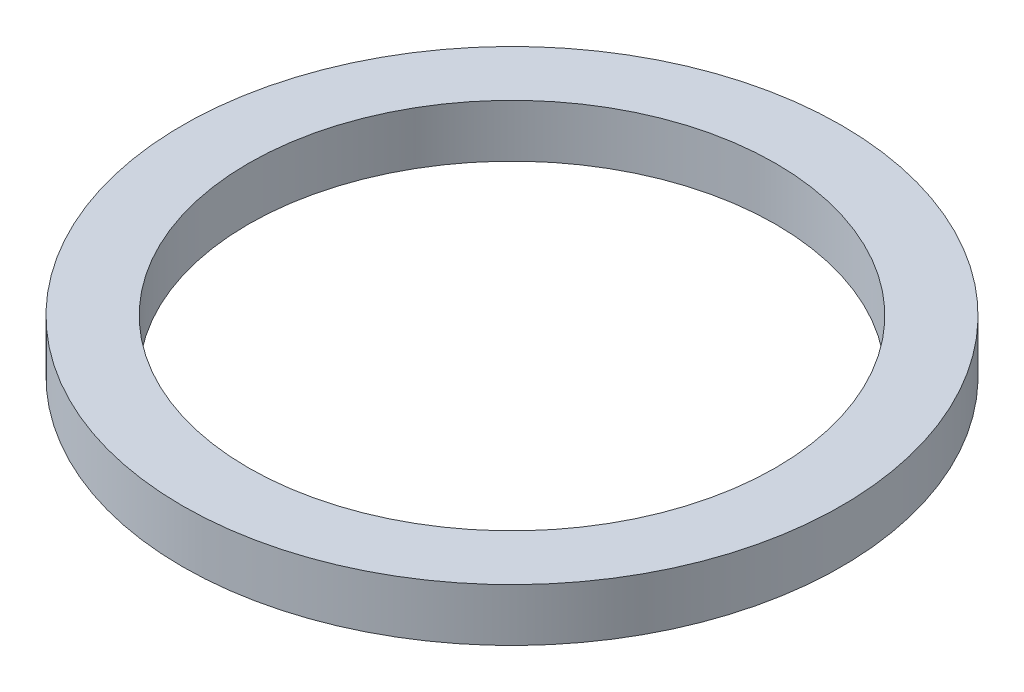
ISO-10303-21;
HEADER;
FILE_DESCRIPTION(('STEP AP214'),'2;1');
FILE_NAME('part.step','',(''),(''),'','','');
FILE_SCHEMA(('AUTOMOTIVE_DESIGN { 1 0 10303 214 1 1 1 1 }'));
ENDSEC;
DATA;
#1=APPLICATION_CONTEXT('core data for automotive mechanical design processes');
#2=APPLICATION_PROTOCOL_DEFINITION('international standard','automotive_design',2000,#1);
#3=PRODUCT_CONTEXT('',#1,'mechanical');
#4=PRODUCT('Part','Part','',(#3));
#5=PRODUCT_RELATED_PRODUCT_CATEGORY('part','',(#4));
#6=PRODUCT_DEFINITION_FORMATION('','',#4);
#7=PRODUCT_DEFINITION_CONTEXT('part definition',#1,'design');
#8=PRODUCT_DEFINITION('design','',#6,#7);
#9=PRODUCT_DEFINITION_SHAPE('','',#8);
#10=(LENGTH_UNIT() NAMED_UNIT(*) SI_UNIT(.MILLI.,.METRE.));
#11=(NAMED_UNIT(*) PLANE_ANGLE_UNIT() SI_UNIT($,.RADIAN.));
#12=(NAMED_UNIT(*) SI_UNIT($,.STERADIAN.) SOLID_ANGLE_UNIT());
#13=UNCERTAINTY_MEASURE_WITH_UNIT(LENGTH_MEASURE(1.E-05),#10,'distance_accuracy_value','');
#14=(GEOMETRIC_REPRESENTATION_CONTEXT(3) GLOBAL_UNCERTAINTY_ASSIGNED_CONTEXT((#13)) GLOBAL_UNIT_ASSIGNED_CONTEXT((#10,
#11,#12)) REPRESENTATION_CONTEXT('',''));
#15=CARTESIAN_POINT('',(0.,0.,0.));
#16=DIRECTION('',(0.,0.,1.));
#17=DIRECTION('',(1.,0.,0.));
#18=AXIS2_PLACEMENT_3D('',#15,#16,#17);
#19=CARTESIAN_POINT('',(0.,3.,0.));
#20=DIRECTION('',(0.,1.,0.));
#21=DIRECTION('',(0.,0.,1.));
#22=AXIS2_PLACEMENT_3D('',#19,#20,#21);
#23=PLANE('',#22);
#24=CARTESIAN_POINT('',(0.,3.,0.));
#25=DIRECTION('',(0.,1.,0.));
#26=DIRECTION('',(0.,0.,1.));
#27=AXIS2_PLACEMENT_3D('',#24,#25,#26);
#28=CIRCLE('',#27,18.75);
#29=CARTESIAN_POINT('',(0.,3.,18.75));
#30=VERTEX_POINT('',#29);
#31=EDGE_CURVE('E10',#30,#30,#28,.T.);
#32=ORIENTED_EDGE('',*,*,#31,.T.);
#33=EDGE_LOOP('',(#32));
#34=FACE_BOUND('',#33,.T.);
#35=CARTESIAN_POINT('',(0.,3.,0.));
#36=DIRECTION('',(0.,1.,0.));
#37=DIRECTION('',(0.,0.,1.));
#38=AXIS2_PLACEMENT_3D('',#35,#36,#37);
#39=CIRCLE('',#38,15.);
#40=CARTESIAN_POINT('',(0.,3.,15.));
#41=VERTEX_POINT('',#40);
#42=EDGE_CURVE('E43',#41,#41,#39,.T.);
#43=ORIENTED_EDGE('',*,*,#42,.F.);
#44=EDGE_LOOP('',(#43));
#45=FACE_BOUND('',#44,.T.);
#46=ADVANCED_FACE('F32',(#34,#45),#23,.T.);
#47=CARTESIAN_POINT('',(0.,0.,0.));
#48=DIRECTION('',(0.,1.,0.));
#49=DIRECTION('',(0.,0.,1.));
#50=AXIS2_PLACEMENT_3D('',#47,#48,#49);
#51=PLANE('',#50);
#52=CARTESIAN_POINT('',(0.,0.,0.));
#53=DIRECTION('',(0.,1.,0.));
#54=DIRECTION('',(0.,0.,1.));
#55=AXIS2_PLACEMENT_3D('',#52,#53,#54);
#56=CIRCLE('',#55,18.75);
#57=CARTESIAN_POINT('',(0.,0.,18.75));
#58=VERTEX_POINT('',#57);
#59=EDGE_CURVE('E36',#58,#58,#56,.T.);
#60=ORIENTED_EDGE('',*,*,#59,.F.);
#61=EDGE_LOOP('',(#60));
#62=FACE_BOUND('',#61,.T.);
#63=CARTESIAN_POINT('',(0.,0.,0.));
#64=DIRECTION('',(0.,1.,0.));
#65=DIRECTION('',(0.,0.,1.));
#66=AXIS2_PLACEMENT_3D('',#63,#64,#65);
#67=CIRCLE('',#66,15.);
#68=CARTESIAN_POINT('',(0.,0.,15.));
#69=VERTEX_POINT('',#68);
#70=EDGE_CURVE('E45',#69,#69,#67,.T.);
#71=ORIENTED_EDGE('',*,*,#70,.T.);
#72=EDGE_LOOP('',(#71));
#73=FACE_BOUND('',#72,.T.);
#74=ADVANCED_FACE('F55',(#62,#73),#51,.F.);
#75=CARTESIAN_POINT('',(0.,3.,0.));
#76=DIRECTION('',(0.,-1.,0.));
#77=DIRECTION('',(0.,0.,-1.));
#78=AXIS2_PLACEMENT_3D('',#75,#76,#77);
#79=CYLINDRICAL_SURFACE('',#78,18.75);
#80=ORIENTED_EDGE('',*,*,#31,.F.);
#81=EDGE_LOOP('',(#80));
#82=FACE_BOUND('',#81,.T.);
#83=ORIENTED_EDGE('',*,*,#59,.T.);
#84=EDGE_LOOP('',(#83));
#85=FACE_BOUND('',#84,.T.);
#86=ADVANCED_FACE('F34',(#82,#85),#79,.T.);
#87=CARTESIAN_POINT('',(0.,3.,0.));
#88=DIRECTION('',(0.,-1.,0.));
#89=DIRECTION('',(0.,0.,-1.));
#90=AXIS2_PLACEMENT_3D('',#87,#88,#89);
#91=CYLINDRICAL_SURFACE('',#90,15.);
#92=ORIENTED_EDGE('',*,*,#42,.T.);
#93=EDGE_LOOP('',(#92));
#94=FACE_BOUND('',#93,.T.);
#95=ORIENTED_EDGE('',*,*,#70,.F.);
#96=EDGE_LOOP('',(#95));
#97=FACE_BOUND('',#96,.T.);
#98=ADVANCED_FACE('F51',(#94,#97),#91,.F.);
#99=CLOSED_SHELL('',(#46,#74,#86,#98));
#100=MANIFOLD_SOLID_BREP('B2',#99);
#101=ADVANCED_BREP_SHAPE_REPRESENTATION('',(#18,#100),#14);
#102=SHAPE_DEFINITION_REPRESENTATION(#9,#101);
ENDSEC;
END-ISO-10303-21;
